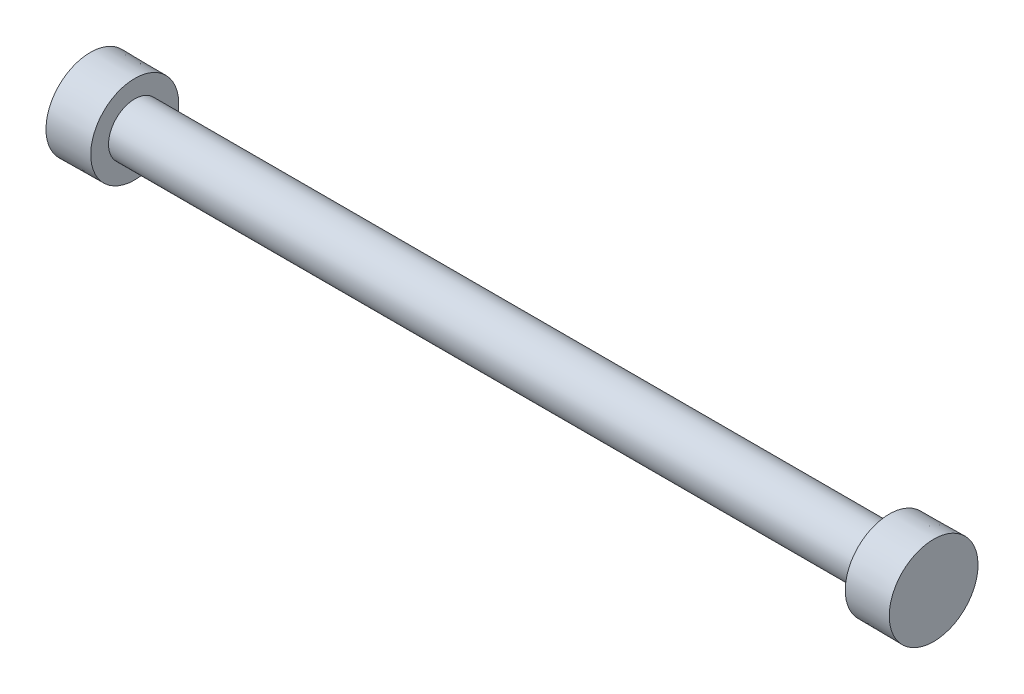
ISO-10303-21;
HEADER;
FILE_DESCRIPTION(('STEP AP214'),'2;1');
FILE_NAME('part.step','',(''),(''),'','','');
FILE_SCHEMA(('AUTOMOTIVE_DESIGN { 1 0 10303 214 1 1 1 1 }'));
ENDSEC;
DATA;
#1=APPLICATION_CONTEXT('core data for automotive mechanical design processes');
#2=APPLICATION_PROTOCOL_DEFINITION('international standard','automotive_design',2000,#1);
#3=PRODUCT_CONTEXT('',#1,'mechanical');
#4=PRODUCT('Part','Part','',(#3));
#5=PRODUCT_RELATED_PRODUCT_CATEGORY('part','',(#4));
#6=PRODUCT_DEFINITION_FORMATION('','',#4);
#7=PRODUCT_DEFINITION_CONTEXT('part definition',#1,'design');
#8=PRODUCT_DEFINITION('design','',#6,#7);
#9=PRODUCT_DEFINITION_SHAPE('','',#8);
#10=(LENGTH_UNIT() NAMED_UNIT(*) SI_UNIT(.MILLI.,.METRE.));
#11=(NAMED_UNIT(*) PLANE_ANGLE_UNIT() SI_UNIT($,.RADIAN.));
#12=(NAMED_UNIT(*) SI_UNIT($,.STERADIAN.) SOLID_ANGLE_UNIT());
#13=UNCERTAINTY_MEASURE_WITH_UNIT(LENGTH_MEASURE(1.E-05),#10,'distance_accuracy_value','');
#14=(GEOMETRIC_REPRESENTATION_CONTEXT(3) GLOBAL_UNCERTAINTY_ASSIGNED_CONTEXT((#13)) GLOBAL_UNIT_ASSIGNED_CONTEXT((#10,
#11,#12)) REPRESENTATION_CONTEXT('',''));
#15=CARTESIAN_POINT('',(0.,0.,0.));
#16=DIRECTION('',(0.,0.,1.));
#17=DIRECTION('',(1.,0.,0.));
#18=AXIS2_PLACEMENT_3D('',#15,#16,#17);
#19=CARTESIAN_POINT('',(-33.1143934892145,0.533154024721067,0.));
#20=DIRECTION('',(1.,0.,0.));
#21=DIRECTION('',(0.,1.,0.));
#22=AXIS2_PLACEMENT_3D('',#19,#20,#21);
#23=PLANE('',#22);
#24=CARTESIAN_POINT('',(-33.1143934892145,0.533154024721067,0.));
#25=DIRECTION('',(-1.,0.,0.));
#26=DIRECTION('',(0.,-1.,0.));
#27=AXIS2_PLACEMENT_3D('',#24,#25,#26);
#28=CIRCLE('',#27,5.);
#29=CARTESIAN_POINT('',(-33.1143934892145,-4.46684597527893,0.));
#30=VERTEX_POINT('',#29);
#31=EDGE_CURVE('E10',#30,#30,#28,.T.);
#32=ORIENTED_EDGE('',*,*,#31,.T.);
#33=EDGE_LOOP('',(#32));
#34=FACE_BOUND('',#33,.T.);
#35=ADVANCED_FACE('F37',(#34),#23,.F.);
#36=CARTESIAN_POINT('',(-28.1145833333333,0.533154024721067,0.));
#37=DIRECTION('',(-1.,0.,0.));
#38=DIRECTION('',(0.,-1.,0.));
#39=AXIS2_PLACEMENT_3D('',#36,#37,#38);
#40=CONICAL_SURFACE('',#39,4.95642930861227,0.00871424856774821);
#41=ORIENTED_EDGE('',*,*,#31,.F.);
#42=EDGE_LOOP('',(#41));
#43=FACE_BOUND('',#42,.T.);
#44=CARTESIAN_POINT('',(-28.1145833333333,0.533154024721067,0.));
#45=DIRECTION('',(-1.,0.,0.));
#46=DIRECTION('',(0.,-1.,0.));
#47=AXIS2_PLACEMENT_3D('',#44,#45,#46);
#48=CIRCLE('',#47,4.95642930861227);
#49=CARTESIAN_POINT('',(-28.1145833333333,-4.4232752838912,0.));
#50=VERTEX_POINT('',#49);
#51=EDGE_CURVE('E44',#50,#50,#48,.T.);
#52=ORIENTED_EDGE('',*,*,#51,.T.);
#53=EDGE_LOOP('',(#52));
#54=FACE_BOUND('',#53,.T.);
#55=ADVANCED_FACE('F81',(#43,#54),#40,.T.);
#56=CARTESIAN_POINT('',(-28.1145833333333,5.48958333333333,0.));
#57=DIRECTION('',(-1.,0.,0.));
#58=DIRECTION('',(0.,-1.,0.));
#59=AXIS2_PLACEMENT_3D('',#56,#57,#58);
#60=PLANE('',#59);
#61=ORIENTED_EDGE('',*,*,#51,.F.);
#62=EDGE_LOOP('',(#61));
#63=FACE_BOUND('',#62,.T.);
#64=CARTESIAN_POINT('',(-28.1145833333333,0.533154024721067,0.));
#65=DIRECTION('',(-1.,0.,0.));
#66=DIRECTION('',(0.,-1.,0.));
#67=AXIS2_PLACEMENT_3D('',#64,#65,#66);
#68=CIRCLE('',#67,2.95642930861227);
#69=CARTESIAN_POINT('',(-28.1145833333333,-2.4232752838912,0.));
#70=VERTEX_POINT('',#69);
#71=EDGE_CURVE('E49',#70,#70,#68,.T.);
#72=ORIENTED_EDGE('',*,*,#71,.T.);
#73=EDGE_LOOP('',(#72));
#74=FACE_BOUND('',#73,.T.);
#75=ADVANCED_FACE('F85',(#63,#74),#60,.F.);
#76=CARTESIAN_POINT('',(-33.1143934892145,0.533154024721067,0.));
#77=DIRECTION('',(-1.,0.,0.));
#78=DIRECTION('',(0.,-1.,0.));
#79=AXIS2_PLACEMENT_3D('',#76,#77,#78);
#80=CYLINDRICAL_SURFACE('',#79,2.95642930861228);
#81=ORIENTED_EDGE('',*,*,#71,.F.);
#82=EDGE_LOOP('',(#81));
#83=FACE_BOUND('',#82,.T.);
#84=CARTESIAN_POINT('',(56.8854166666667,0.533154024721053,0.));
#85=DIRECTION('',(-1.,0.,0.));
#86=DIRECTION('',(0.,-1.,0.));
#87=AXIS2_PLACEMENT_3D('',#84,#85,#86);
#88=CIRCLE('',#87,2.95642930861228);
#89=CARTESIAN_POINT('',(56.8854166666667,-2.42327528389123,0.));
#90=VERTEX_POINT('',#89);
#91=EDGE_CURVE('E54',#90,#90,#88,.T.);
#92=ORIENTED_EDGE('',*,*,#91,.T.);
#93=EDGE_LOOP('',(#92));
#94=FACE_BOUND('',#93,.T.);
#95=ADVANCED_FACE('F90',(#83,#94),#80,.T.);
#96=CARTESIAN_POINT('',(56.8854166666667,3.48958333333333,0.));
#97=DIRECTION('',(1.,0.,0.));
#98=DIRECTION('',(0.,1.,0.));
#99=AXIS2_PLACEMENT_3D('',#96,#97,#98);
#100=PLANE('',#99);
#101=ORIENTED_EDGE('',*,*,#91,.F.);
#102=EDGE_LOOP('',(#101));
#103=FACE_BOUND('',#102,.T.);
#104=CARTESIAN_POINT('',(56.8854166666667,0.533154024721053,0.));
#105=DIRECTION('',(-1.,0.,0.));
#106=DIRECTION('',(0.,-1.,0.));
#107=AXIS2_PLACEMENT_3D('',#104,#105,#106);
#108=CIRCLE('',#107,4.95642930861227);
#109=CARTESIAN_POINT('',(56.8854166666667,-4.42327528389122,0.));
#110=VERTEX_POINT('',#109);
#111=EDGE_CURVE('E60',#110,#110,#108,.T.);
#112=ORIENTED_EDGE('',*,*,#111,.T.);
#113=EDGE_LOOP('',(#112));
#114=FACE_BOUND('',#113,.T.);
#115=ADVANCED_FACE('F77',(#103,#114),#100,.F.);
#116=CARTESIAN_POINT('',(61.8852268225478,0.533154024721053,0.));
#117=DIRECTION('',(1.,0.,0.));
#118=DIRECTION('',(0.,1.,0.));
#119=AXIS2_PLACEMENT_3D('',#116,#117,#118);
#120=CONICAL_SURFACE('',#119,5.,0.00871424856774754);
#121=ORIENTED_EDGE('',*,*,#111,.F.);
#122=EDGE_LOOP('',(#121));
#123=FACE_BOUND('',#122,.T.);
#124=CARTESIAN_POINT('',(61.8852268225478,0.533154024721053,0.));
#125=DIRECTION('',(-1.,0.,0.));
#126=DIRECTION('',(0.,-1.,0.));
#127=AXIS2_PLACEMENT_3D('',#124,#125,#126);
#128=CIRCLE('',#127,5.);
#129=CARTESIAN_POINT('',(61.8852268225478,-4.46684597527895,0.));
#130=VERTEX_POINT('',#129);
#131=EDGE_CURVE('E64',#130,#130,#128,.T.);
#132=ORIENTED_EDGE('',*,*,#131,.T.);
#133=EDGE_LOOP('',(#132));
#134=FACE_BOUND('',#133,.T.);
#135=ADVANCED_FACE('F69',(#123,#134),#120,.T.);
#136=CARTESIAN_POINT('',(61.8852268225478,5.53315402472105,0.));
#137=DIRECTION('',(-1.,0.,0.));
#138=DIRECTION('',(0.,-1.,0.));
#139=AXIS2_PLACEMENT_3D('',#136,#137,#138);
#140=PLANE('',#139);
#141=ORIENTED_EDGE('',*,*,#131,.F.);
#142=EDGE_LOOP('',(#141));
#143=FACE_BOUND('',#142,.T.);
#144=ADVANCED_FACE('F71',(#143),#140,.F.);
#145=CLOSED_SHELL('',(#35,#55,#75,#95,#115,#135,#144));
#146=MANIFOLD_SOLID_BREP('B2',#145);
#147=ADVANCED_BREP_SHAPE_REPRESENTATION('',(#18,#146),#14);
#148=SHAPE_DEFINITION_REPRESENTATION(#9,#147);
ENDSEC;
END-ISO-10303-21;
